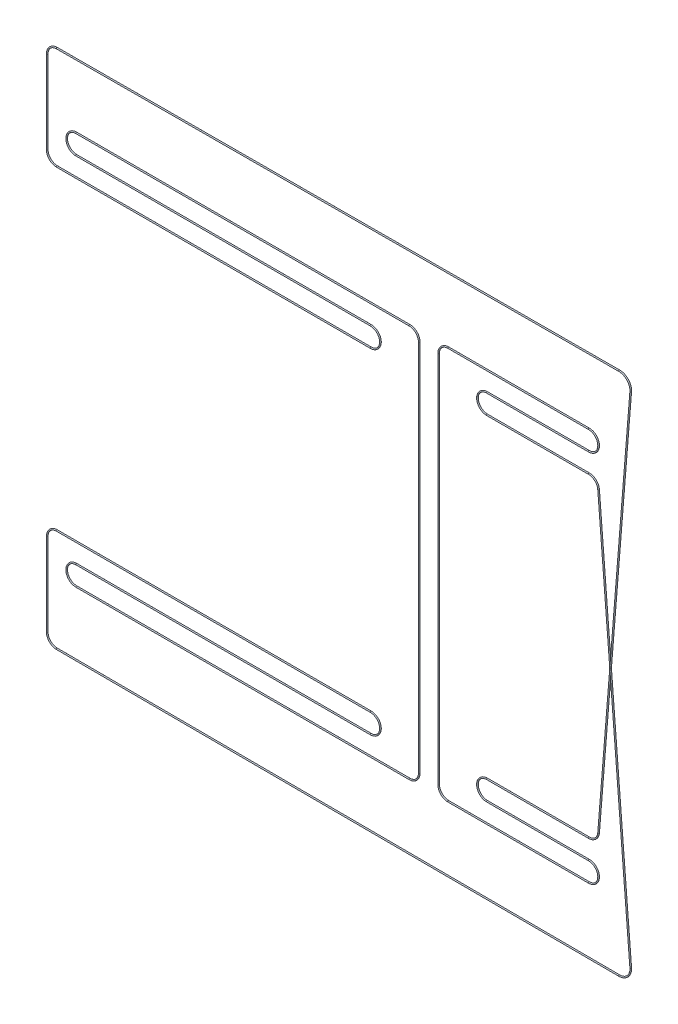
ISO-10303-21;
HEADER;
FILE_DESCRIPTION(('STEP AP214'),'2;1');
FILE_NAME('part.step','',(''),(''),'','','');
FILE_SCHEMA(('AUTOMOTIVE_DESIGN { 1 0 10303 214 1 1 1 1 }'));
ENDSEC;
DATA;
#1=APPLICATION_CONTEXT('core data for automotive mechanical design processes');
#2=APPLICATION_PROTOCOL_DEFINITION('international standard','automotive_design',2000,#1);
#3=PRODUCT_CONTEXT('',#1,'mechanical');
#4=PRODUCT('Part','Part','',(#3));
#5=PRODUCT_RELATED_PRODUCT_CATEGORY('part','',(#4));
#6=PRODUCT_DEFINITION_FORMATION('','',#4);
#7=PRODUCT_DEFINITION_CONTEXT('part definition',#1,'design');
#8=PRODUCT_DEFINITION('design','',#6,#7);
#9=PRODUCT_DEFINITION_SHAPE('','',#8);
#10=(LENGTH_UNIT() NAMED_UNIT(*) SI_UNIT(.MILLI.,.METRE.));
#11=(NAMED_UNIT(*) PLANE_ANGLE_UNIT() SI_UNIT($,.RADIAN.));
#12=(NAMED_UNIT(*) SI_UNIT($,.STERADIAN.) SOLID_ANGLE_UNIT());
#13=UNCERTAINTY_MEASURE_WITH_UNIT(LENGTH_MEASURE(1.E-05),#10,'distance_accuracy_value','');
#14=(GEOMETRIC_REPRESENTATION_CONTEXT(3) GLOBAL_UNCERTAINTY_ASSIGNED_CONTEXT((#13)) GLOBAL_UNIT_ASSIGNED_CONTEXT((#10,
#11,#12)) REPRESENTATION_CONTEXT('',''));
#15=CARTESIAN_POINT('',(0.,0.,0.));
#16=DIRECTION('',(0.,0.,1.));
#17=DIRECTION('',(1.,0.,0.));
#18=AXIS2_PLACEMENT_3D('',#15,#16,#17);
#19=CARTESIAN_POINT('',(462.434227680862,-51.7359796285489,-2.5));
#20=DIRECTION('',(-0.0804231969948115,0.996760808511818,0.));
#21=DIRECTION('',(0.,0.,1.));
#22=AXIS2_PLACEMENT_3D('',#19,#20,#21);
#23=CYLINDRICAL_SURFACE('',#22,0.5);
#24=CARTESIAN_POINT('',(445.83451280715,153.999999999999,-2.5));
#25=DIRECTION('',(0.,1.,0.));
#26=DIRECTION('',(-1.,0.,0.));
#27=AXIS2_PLACEMENT_3D('',#24,#25,#26);
#28=ELLIPSE('',#27,0.501624858973446,0.5);
#29=CARTESIAN_POINT('',(445.83451280715,153.999999999999,-2.));
#30=VERTEX_POINT('',#29);
#31=CARTESIAN_POINT('',(445.83451280715,153.999999999999,-3.));
#32=VERTEX_POINT('',#31);
#33=EDGE_CURVE('E25',#30,#32,#28,.T.);
#34=ORIENTED_EDGE('',*,*,#33,.F.);
#35=CARTESIAN_POINT('',(445.83451280715,153.999999999999,-2.5));
#36=DIRECTION('',(-1.,0.,0.));
#37=DIRECTION('',(0.,-1.,0.));
#38=AXIS2_PLACEMENT_3D('',#35,#36,#37);
#39=ELLIPSE('',#38,6.21711171258534,0.5);
#40=EDGE_CURVE('E31',#32,#30,#39,.T.);
#41=ORIENTED_EDGE('',*,*,#40,.F.);
#42=EDGE_LOOP('',(#34,#41));
#43=FACE_BOUND('',#42,.T.);
#44=CARTESIAN_POINT('',(462.434227680862,-51.7359796285489,-2.5));
#45=DIRECTION('',(0.0804231969948115,-0.996760808511818,0.));
#46=DIRECTION('',(0.,0.,-1.));
#47=AXIS2_PLACEMENT_3D('',#44,#45,#46);
#48=CIRCLE('',#47,0.5);
#49=CARTESIAN_POINT('',(462.932608085118,-51.6957680300515,-2.5));
#50=VERTEX_POINT('',#49);
#51=EDGE_CURVE('E275',#50,#50,#48,.T.);
#52=ORIENTED_EDGE('',*,*,#51,.F.);
#53=EDGE_LOOP('',(#52));
#54=FACE_BOUND('',#53,.T.);
#55=ADVANCED_FACE('F15',(#43,#54),#23,.T.);
#56=CARTESIAN_POINT('',(462.434227680862,-51.7359796285489,-2.5));
#57=DIRECTION('',(-0.0804231969948115,0.996760808511818,0.));
#58=DIRECTION('',(0.,0.,1.));
#59=AXIS2_PLACEMENT_3D('',#56,#57,#58);
#60=CYLINDRICAL_SURFACE('',#59,0.5);
#61=CARTESIAN_POINT('',(435.939086468095,276.643385575958,-2.5));
#62=DIRECTION('',(-0.0804231969948297,0.996760808511817,0.));
#63=DIRECTION('',(0.,0.,1.));
#64=AXIS2_PLACEMENT_3D('',#61,#62,#63);
#65=CIRCLE('',#64,0.5);
#66=CARTESIAN_POINT('',(436.43746687235,276.683597174456,-2.5));
#67=VERTEX_POINT('',#66);
#68=EDGE_CURVE('E48',#67,#67,#65,.T.);
#69=ORIENTED_EDGE('',*,*,#68,.F.);
#70=EDGE_LOOP('',(#69));
#71=FACE_BOUND('',#70,.T.);
#72=CARTESIAN_POINT('',(445.83451280715,153.999999999999,-2.5));
#73=DIRECTION('',(0.,-1.,0.));
#74=DIRECTION('',(-1.,0.,0.));
#75=AXIS2_PLACEMENT_3D('',#72,#73,#74);
#76=ELLIPSE('',#75,0.501624858973446,0.5);
#77=EDGE_CURVE('E37',#30,#32,#76,.T.);
#78=ORIENTED_EDGE('',*,*,#77,.F.);
#79=CARTESIAN_POINT('',(445.83451280715,153.999999999999,-2.5));
#80=DIRECTION('',(1.,0.,0.));
#81=DIRECTION('',(0.,-1.,0.));
#82=AXIS2_PLACEMENT_3D('',#79,#80,#81);
#83=ELLIPSE('',#82,6.21711171258534,0.5);
#84=EDGE_CURVE('E9',#32,#30,#83,.T.);
#85=ORIENTED_EDGE('',*,*,#84,.F.);
#86=EDGE_LOOP('',(#78,#85));
#87=FACE_BOUND('',#86,.T.);
#88=ADVANCED_FACE('F50',(#71,#87),#60,.T.);
#89=CARTESIAN_POINT('',(462.434227680863,359.73597962855,-2.5));
#90=DIRECTION('',(-0.0804231969948115,-0.996760808511818,0.));
#91=DIRECTION('',(-0.996760808511818,0.0804231969948115,0.));
#92=AXIS2_PLACEMENT_3D('',#89,#90,#91);
#93=CYLINDRICAL_SURFACE('',#92,0.5);
#94=CARTESIAN_POINT('',(462.434227680863,359.73597962855,-2.5));
#95=DIRECTION('',(0.0804231969947969,0.996760808511819,0.));
#96=DIRECTION('',(0.,0.,-1.));
#97=AXIS2_PLACEMENT_3D('',#94,#95,#96);
#98=CIRCLE('',#97,0.5);
#99=CARTESIAN_POINT('',(462.932608085118,359.695768030052,-2.5));
#100=VERTEX_POINT('',#99);
#101=EDGE_CURVE('E227',#100,#100,#98,.T.);
#102=ORIENTED_EDGE('',*,*,#101,.F.);
#103=EDGE_LOOP('',(#102));
#104=FACE_BOUND('',#103,.T.);
#105=ORIENTED_EDGE('',*,*,#84,.T.);
#106=ORIENTED_EDGE('',*,*,#33,.T.);
#107=EDGE_LOOP('',(#105,#106));
#108=FACE_BOUND('',#107,.T.);
#109=ADVANCED_FACE('F47',(#104,#108),#93,.T.);
#110=CARTESIAN_POINT('',(427.965,276.,-2.5));
#111=DIRECTION('',(0.,0.,-1.));
#112=DIRECTION('',(0.,-1.,0.));
#113=AXIS2_PLACEMENT_3D('',#110,#111,#112);
#114=TOROIDAL_SURFACE('',#113,8.00000000000008,0.5);
#115=CARTESIAN_POINT('',(427.965,284.,-2.5));
#116=DIRECTION('',(-1.,0.,0.));
#117=DIRECTION('',(0.,1.,0.));
#118=AXIS2_PLACEMENT_3D('',#115,#116,#117);
#119=CIRCLE('',#118,0.5);
#120=CARTESIAN_POINT('',(427.965,284.5,-2.5));
#121=VERTEX_POINT('',#120);
#122=EDGE_CURVE('E268',#121,#121,#119,.T.);
#123=CARTESIAN_POINT('',(427.965,276.,-2.5));
#124=DIRECTION('',(0.,0.,-1.));
#125=DIRECTION('',(0.,-1.,0.));
#126=AXIS2_PLACEMENT_3D('',#123,#124,#125);
#127=CIRCLE('',#126,8.50000000000008);
#128=EDGE_CURVE('',#121,#67,#127,.T.);
#129=ORIENTED_EDGE('',*,*,#122,.F.);
#130=ORIENTED_EDGE('',*,*,#68,.T.);
#131=ORIENTED_EDGE('',*,*,#128,.T.);
#132=ORIENTED_EDGE('',*,*,#128,.F.);
#133=EDGE_LOOP('',(#129,#131,#130,#132));
#134=FACE_BOUND('',#133,.T.);
#135=ADVANCED_FACE('F59',(#134),#114,.T.);
#136=CARTESIAN_POINT('',(344.038707856481,284.000000000001,-2.5));
#137=DIRECTION('',(1.,0.,0.));
#138=DIRECTION('',(0.,0.,1.));
#139=AXIS2_PLACEMENT_3D('',#136,#137,#138);
#140=CYLINDRICAL_SURFACE('',#139,0.5);
#141=ORIENTED_EDGE('',*,*,#122,.T.);
#142=EDGE_LOOP('',(#141));
#143=FACE_BOUND('',#142,.T.);
#144=CARTESIAN_POINT('',(344.038707856481,284.000000000001,-2.5));
#145=DIRECTION('',(-1.,0.,0.));
#146=DIRECTION('',(0.,1.,0.));
#147=AXIS2_PLACEMENT_3D('',#144,#145,#146);
#148=CIRCLE('',#147,0.5);
#149=CARTESIAN_POINT('',(344.038707856481,283.500000000001,-2.5));
#150=VERTEX_POINT('',#149);
#151=EDGE_CURVE('E265',#150,#150,#148,.T.);
#152=ORIENTED_EDGE('',*,*,#151,.F.);
#153=EDGE_LOOP('',(#152));
#154=FACE_BOUND('',#153,.T.);
#155=ADVANCED_FACE('F68',(#143,#154),#140,.T.);
#156=CARTESIAN_POINT('',(344.038707856481,292.,-2.5));
#157=DIRECTION('',(0.,0.,1.));
#158=DIRECTION('',(1.,0.,0.));
#159=AXIS2_PLACEMENT_3D('',#156,#157,#158);
#160=TOROIDAL_SURFACE('',#159,7.99999999999972,0.5);
#161=CARTESIAN_POINT('',(344.038707856481,300.,-2.5));
#162=DIRECTION('',(1.,0.,0.));
#163=DIRECTION('',(0.,1.,0.));
#164=AXIS2_PLACEMENT_3D('',#161,#162,#163);
#165=CIRCLE('',#164,0.5);
#166=CARTESIAN_POINT('',(344.038707856481,300.5,-2.5));
#167=VERTEX_POINT('',#166);
#168=EDGE_CURVE('E262',#167,#167,#165,.T.);
#169=CARTESIAN_POINT('',(344.038707856481,292.,-2.5));
#170=DIRECTION('',(0.,0.,1.));
#171=DIRECTION('',(1.,0.,0.));
#172=AXIS2_PLACEMENT_3D('',#169,#170,#171);
#173=CIRCLE('',#172,8.49999999999972);
#174=EDGE_CURVE('',#167,#150,#173,.T.);
#175=ORIENTED_EDGE('',*,*,#168,.F.);
#176=ORIENTED_EDGE('',*,*,#151,.T.);
#177=ORIENTED_EDGE('',*,*,#174,.T.);
#178=ORIENTED_EDGE('',*,*,#174,.F.);
#179=EDGE_LOOP('',(#175,#177,#176,#178));
#180=FACE_BOUND('',#179,.T.);
#181=ADVANCED_FACE('F71',(#180),#160,.T.);
#182=CARTESIAN_POINT('',(427.965,300.,-2.5));
#183=DIRECTION('',(-1.,0.,0.));
#184=DIRECTION('',(0.,0.,1.));
#185=AXIS2_PLACEMENT_3D('',#182,#183,#184);
#186=CYLINDRICAL_SURFACE('',#185,0.5);
#187=ORIENTED_EDGE('',*,*,#168,.T.);
#188=EDGE_LOOP('',(#187));
#189=FACE_BOUND('',#188,.T.);
#190=CARTESIAN_POINT('',(427.965,300.,-2.5));
#191=DIRECTION('',(1.,0.,0.));
#192=DIRECTION('',(0.,1.,0.));
#193=AXIS2_PLACEMENT_3D('',#190,#191,#192);
#194=CIRCLE('',#193,0.5);
#195=CARTESIAN_POINT('',(427.965,299.5,-2.5));
#196=VERTEX_POINT('',#195);
#197=EDGE_CURVE('E259',#196,#196,#194,.T.);
#198=ORIENTED_EDGE('',*,*,#197,.F.);
#199=EDGE_LOOP('',(#198));
#200=FACE_BOUND('',#199,.T.);
#201=ADVANCED_FACE('F73',(#189,#200),#186,.T.);
#202=CARTESIAN_POINT('',(427.965,308.,-2.5));
#203=DIRECTION('',(0.,0.,-1.));
#204=DIRECTION('',(0.,-1.,0.));
#205=AXIS2_PLACEMENT_3D('',#202,#203,#204);
#206=TOROIDAL_SURFACE('',#205,8.00000000000047,0.5);
#207=CARTESIAN_POINT('',(427.965,316.000000000001,-2.5));
#208=DIRECTION('',(-1.,0.,0.));
#209=DIRECTION('',(0.,1.,0.));
#210=AXIS2_PLACEMENT_3D('',#207,#208,#209);
#211=CIRCLE('',#210,0.5);
#212=CARTESIAN_POINT('',(427.965,316.500000000001,-2.5));
#213=VERTEX_POINT('',#212);
#214=EDGE_CURVE('E256',#213,#213,#211,.T.);
#215=CARTESIAN_POINT('',(427.965,308.,-2.5));
#216=DIRECTION('',(0.,0.,-1.));
#217=DIRECTION('',(0.,-1.,0.));
#218=AXIS2_PLACEMENT_3D('',#215,#216,#217);
#219=CIRCLE('',#218,8.50000000000047);
#220=EDGE_CURVE('',#213,#196,#219,.T.);
#221=ORIENTED_EDGE('',*,*,#214,.F.);
#222=ORIENTED_EDGE('',*,*,#197,.T.);
#223=ORIENTED_EDGE('',*,*,#220,.T.);
#224=ORIENTED_EDGE('',*,*,#220,.F.);
#225=EDGE_LOOP('',(#221,#223,#222,#224));
#226=FACE_BOUND('',#225,.T.);
#227=ADVANCED_FACE('F76',(#226),#206,.T.);
#228=CARTESIAN_POINT('',(312.038707856481,316.000000000001,-2.5));
#229=DIRECTION('',(1.,0.,0.));
#230=DIRECTION('',(0.,1.,0.));
#231=AXIS2_PLACEMENT_3D('',#228,#229,#230);
#232=CYLINDRICAL_SURFACE('',#231,0.5);
#233=ORIENTED_EDGE('',*,*,#214,.T.);
#234=EDGE_LOOP('',(#233));
#235=FACE_BOUND('',#234,.T.);
#236=CARTESIAN_POINT('',(312.038707856481,316.000000000001,-2.5));
#237=DIRECTION('',(-1.,0.,0.));
#238=DIRECTION('',(0.,1.,0.));
#239=AXIS2_PLACEMENT_3D('',#236,#237,#238);
#240=CIRCLE('',#239,0.5);
#241=CARTESIAN_POINT('',(312.038707856481,316.500000000001,-2.5));
#242=VERTEX_POINT('',#241);
#243=EDGE_CURVE('E253',#242,#242,#240,.T.);
#244=ORIENTED_EDGE('',*,*,#243,.F.);
#245=EDGE_LOOP('',(#244));
#246=FACE_BOUND('',#245,.T.);
#247=ADVANCED_FACE('F78',(#235,#246),#232,.T.);
#248=CARTESIAN_POINT('',(312.038707856481,308.000000000001,-2.5));
#249=DIRECTION('',(0.,0.,-1.));
#250=DIRECTION('',(0.,-1.,0.));
#251=AXIS2_PLACEMENT_3D('',#248,#249,#250);
#252=TOROIDAL_SURFACE('',#251,8.00000000000018,0.5);
#253=CARTESIAN_POINT('',(304.038707856481,308.000000000001,-2.5));
#254=DIRECTION('',(0.,-1.,0.));
#255=DIRECTION('',(0.,0.,-1.));
#256=AXIS2_PLACEMENT_3D('',#253,#254,#255);
#257=CIRCLE('',#256,0.5);
#258=CARTESIAN_POINT('',(303.538707856481,308.000000000001,-2.5));
#259=VERTEX_POINT('',#258);
#260=EDGE_CURVE('E250',#259,#259,#257,.T.);
#261=CARTESIAN_POINT('',(312.038707856481,308.000000000001,-2.5));
#262=DIRECTION('',(0.,0.,-1.));
#263=DIRECTION('',(0.,-1.,0.));
#264=AXIS2_PLACEMENT_3D('',#261,#262,#263);
#265=CIRCLE('',#264,8.50000000000018);
#266=EDGE_CURVE('',#259,#242,#265,.T.);
#267=ORIENTED_EDGE('',*,*,#260,.F.);
#268=ORIENTED_EDGE('',*,*,#243,.T.);
#269=ORIENTED_EDGE('',*,*,#266,.T.);
#270=ORIENTED_EDGE('',*,*,#266,.F.);
#271=EDGE_LOOP('',(#267,#269,#268,#270));
#272=FACE_BOUND('',#271,.T.);
#273=ADVANCED_FACE('F81',(#272),#252,.T.);
#274=CARTESIAN_POINT('',(304.038707856481,3.19744231092045E-13,-2.5));
#275=DIRECTION('',(0.,1.,0.));
#276=DIRECTION('',(1.,0.,0.));
#277=AXIS2_PLACEMENT_3D('',#274,#275,#276);
#278=CYLINDRICAL_SURFACE('',#277,0.5);
#279=ORIENTED_EDGE('',*,*,#260,.T.);
#280=EDGE_LOOP('',(#279));
#281=FACE_BOUND('',#280,.T.);
#282=CARTESIAN_POINT('',(304.038707856481,3.19744231092045E-13,-2.5));
#283=DIRECTION('',(0.,-1.,0.));
#284=DIRECTION('',(0.,0.,-1.));
#285=AXIS2_PLACEMENT_3D('',#282,#283,#284);
#286=CIRCLE('',#285,0.5);
#287=CARTESIAN_POINT('',(303.538707856481,3.23074900165921E-13,-2.5));
#288=VERTEX_POINT('',#287);
#289=EDGE_CURVE('E247',#288,#288,#286,.T.);
#290=ORIENTED_EDGE('',*,*,#289,.F.);
#291=EDGE_LOOP('',(#290));
#292=FACE_BOUND('',#291,.T.);
#293=ADVANCED_FACE('F83',(#281,#292),#278,.T.);
#294=CARTESIAN_POINT('',(312.038707856481,2.66453525910038E-13,-2.5));
#295=DIRECTION('',(0.,0.,-1.));
#296=DIRECTION('',(0.,-1.,0.));
#297=AXIS2_PLACEMENT_3D('',#294,#295,#296);
#298=TOROIDAL_SURFACE('',#297,8.00000000000019,0.5);
#299=CARTESIAN_POINT('',(312.038707856481,-7.99999999999993,-2.5));
#300=DIRECTION('',(1.,0.,0.));
#301=DIRECTION('',(0.,1.,0.));
#302=AXIS2_PLACEMENT_3D('',#299,#300,#301);
#303=CIRCLE('',#302,0.5);
#304=CARTESIAN_POINT('',(312.038707856481,-8.49999999999993,-2.5));
#305=VERTEX_POINT('',#304);
#306=EDGE_CURVE('E244',#305,#305,#303,.T.);
#307=CARTESIAN_POINT('',(312.038707856481,2.66453525910038E-13,-2.5));
#308=DIRECTION('',(0.,0.,-1.));
#309=DIRECTION('',(0.,-1.,0.));
#310=AXIS2_PLACEMENT_3D('',#307,#308,#309);
#311=CIRCLE('',#310,8.5000000000002);
#312=EDGE_CURVE('',#305,#288,#311,.T.);
#313=ORIENTED_EDGE('',*,*,#306,.F.);
#314=ORIENTED_EDGE('',*,*,#289,.T.);
#315=ORIENTED_EDGE('',*,*,#312,.T.);
#316=ORIENTED_EDGE('',*,*,#312,.F.);
#317=EDGE_LOOP('',(#313,#315,#314,#316));
#318=FACE_BOUND('',#317,.T.);
#319=ADVANCED_FACE('F86',(#318),#298,.T.);
#320=CARTESIAN_POINT('',(427.965,-7.99999999999943,-2.5));
#321=DIRECTION('',(-1.,0.,0.));
#322=DIRECTION('',(0.,1.,0.));
#323=AXIS2_PLACEMENT_3D('',#320,#321,#322);
#324=CYLINDRICAL_SURFACE('',#323,0.5);
#325=ORIENTED_EDGE('',*,*,#306,.T.);
#326=EDGE_LOOP('',(#325));
#327=FACE_BOUND('',#326,.T.);
#328=CARTESIAN_POINT('',(427.965,-7.99999999999943,-2.5));
#329=DIRECTION('',(1.,0.,0.));
#330=DIRECTION('',(0.,1.,0.));
#331=AXIS2_PLACEMENT_3D('',#328,#329,#330);
#332=CIRCLE('',#331,0.5);
#333=CARTESIAN_POINT('',(427.965,-8.49999999999944,-2.5));
#334=VERTEX_POINT('',#333);
#335=EDGE_CURVE('E241',#334,#334,#332,.T.);
#336=ORIENTED_EDGE('',*,*,#335,.F.);
#337=EDGE_LOOP('',(#336));
#338=FACE_BOUND('',#337,.T.);
#339=ADVANCED_FACE('F107',(#327,#338),#324,.T.);
#340=CARTESIAN_POINT('',(427.965,7.62723217917483E-13,-2.5));
#341=DIRECTION('',(0.,0.,-1.));
#342=DIRECTION('',(0.,-1.,0.));
#343=AXIS2_PLACEMENT_3D('',#340,#341,#342);
#344=TOROIDAL_SURFACE('',#343,8.0000000000002,0.5);
#345=CARTESIAN_POINT('',(427.965,8.00000000000096,-2.5));
#346=DIRECTION('',(-1.,0.,0.));
#347=DIRECTION('',(0.,1.,0.));
#348=AXIS2_PLACEMENT_3D('',#345,#346,#347);
#349=CIRCLE('',#348,0.5);
#350=CARTESIAN_POINT('',(427.965,8.50000000000096,-2.5));
#351=VERTEX_POINT('',#350);
#352=EDGE_CURVE('E238',#351,#351,#349,.T.);
#353=CARTESIAN_POINT('',(427.965,7.62723217917483E-13,-2.5));
#354=DIRECTION('',(0.,0.,-1.));
#355=DIRECTION('',(0.,-1.,0.));
#356=AXIS2_PLACEMENT_3D('',#353,#354,#355);
#357=CIRCLE('',#356,8.5000000000002);
#358=EDGE_CURVE('',#351,#334,#357,.T.);
#359=ORIENTED_EDGE('',*,*,#352,.F.);
#360=ORIENTED_EDGE('',*,*,#335,.T.);
#361=ORIENTED_EDGE('',*,*,#358,.T.);
#362=ORIENTED_EDGE('',*,*,#358,.F.);
#363=EDGE_LOOP('',(#359,#361,#360,#362));
#364=FACE_BOUND('',#363,.T.);
#365=ADVANCED_FACE('F92',(#364),#344,.T.);
#366=CARTESIAN_POINT('',(344.038707856481,8.0000000000006,-2.5));
#367=DIRECTION('',(1.,0.,0.));
#368=DIRECTION('',(0.,1.,0.));
#369=AXIS2_PLACEMENT_3D('',#366,#367,#368);
#370=CYLINDRICAL_SURFACE('',#369,0.5);
#371=ORIENTED_EDGE('',*,*,#352,.T.);
#372=EDGE_LOOP('',(#371));
#373=FACE_BOUND('',#372,.T.);
#374=CARTESIAN_POINT('',(344.038707856481,8.0000000000006,-2.5));
#375=DIRECTION('',(-1.,0.,0.));
#376=DIRECTION('',(0.,1.,0.));
#377=AXIS2_PLACEMENT_3D('',#374,#375,#376);
#378=CIRCLE('',#377,0.5);
#379=CARTESIAN_POINT('',(344.038707856481,7.50000000000059,-2.5));
#380=VERTEX_POINT('',#379);
#381=EDGE_CURVE('E235',#380,#380,#378,.T.);
#382=ORIENTED_EDGE('',*,*,#381,.F.);
#383=EDGE_LOOP('',(#382));
#384=FACE_BOUND('',#383,.T.);
#385=ADVANCED_FACE('F88',(#373,#384),#370,.T.);
#386=CARTESIAN_POINT('',(344.038707856481,16.0000000000004,-2.5));
#387=DIRECTION('',(0.,0.,1.));
#388=DIRECTION('',(1.,0.,0.));
#389=AXIS2_PLACEMENT_3D('',#386,#387,#388);
#390=TOROIDAL_SURFACE('',#389,7.99999999999981,0.5);
#391=CARTESIAN_POINT('',(344.038707856481,24.0000000000002,-2.5));
#392=DIRECTION('',(1.,0.,0.));
#393=DIRECTION('',(0.,1.,0.));
#394=AXIS2_PLACEMENT_3D('',#391,#392,#393);
#395=CIRCLE('',#394,0.5);
#396=CARTESIAN_POINT('',(344.038707856481,24.5000000000002,-2.5));
#397=VERTEX_POINT('',#396);
#398=EDGE_CURVE('E232',#397,#397,#395,.T.);
#399=CARTESIAN_POINT('',(344.038707856481,16.0000000000004,-2.5));
#400=DIRECTION('',(0.,0.,1.));
#401=DIRECTION('',(1.,0.,0.));
#402=AXIS2_PLACEMENT_3D('',#399,#400,#401);
#403=CIRCLE('',#402,8.49999999999982);
#404=EDGE_CURVE('',#397,#380,#403,.T.);
#405=ORIENTED_EDGE('',*,*,#398,.F.);
#406=ORIENTED_EDGE('',*,*,#381,.T.);
#407=ORIENTED_EDGE('',*,*,#404,.T.);
#408=ORIENTED_EDGE('',*,*,#404,.F.);
#409=EDGE_LOOP('',(#405,#407,#406,#408));
#410=FACE_BOUND('',#409,.T.);
#411=ADVANCED_FACE('F91',(#410),#390,.T.);
#412=CARTESIAN_POINT('',(427.965,24.0000000000006,-2.5));
#413=DIRECTION('',(-1.,0.,0.));
#414=DIRECTION('',(0.,1.,0.));
#415=AXIS2_PLACEMENT_3D('',#412,#413,#414);
#416=CYLINDRICAL_SURFACE('',#415,0.5);
#417=ORIENTED_EDGE('',*,*,#398,.T.);
#418=EDGE_LOOP('',(#417));
#419=FACE_BOUND('',#418,.T.);
#420=CARTESIAN_POINT('',(427.965,24.0000000000006,-2.5));
#421=DIRECTION('',(1.,0.,0.));
#422=DIRECTION('',(0.,1.,0.));
#423=AXIS2_PLACEMENT_3D('',#420,#421,#422);
#424=CIRCLE('',#423,0.5);
#425=CARTESIAN_POINT('',(427.965,23.5000000000006,-2.5));
#426=VERTEX_POINT('',#425);
#427=EDGE_CURVE('E44',#426,#426,#424,.T.);
#428=ORIENTED_EDGE('',*,*,#427,.F.);
#429=EDGE_LOOP('',(#428));
#430=FACE_BOUND('',#429,.T.);
#431=ADVANCED_FACE('F94',(#419,#430),#416,.T.);
#432=CARTESIAN_POINT('',(427.965,32.0000000000008,-2.5));
#433=DIRECTION('',(0.,0.,-1.));
#434=DIRECTION('',(0.,-1.,0.));
#435=AXIS2_PLACEMENT_3D('',#432,#433,#434);
#436=TOROIDAL_SURFACE('',#435,8.00000000000019,0.5);
#437=CARTESIAN_POINT('',(435.939086468095,31.3566144240421,-2.5));
#438=DIRECTION('',(0.0804231969947969,0.996760808511819,0.));
#439=DIRECTION('',(0.,0.,-1.));
#440=AXIS2_PLACEMENT_3D('',#437,#438,#439);
#441=CIRCLE('',#440,0.5);
#442=CARTESIAN_POINT('',(436.437466872351,31.3164028255447,-2.5));
#443=VERTEX_POINT('',#442);
#444=EDGE_CURVE('E38',#443,#443,#441,.T.);
#445=CARTESIAN_POINT('',(427.965,32.0000000000008,-2.5));
#446=DIRECTION('',(0.,0.,-1.));
#447=DIRECTION('',(0.,-1.,0.));
#448=AXIS2_PLACEMENT_3D('',#445,#446,#447);
#449=CIRCLE('',#448,8.50000000000019);
#450=EDGE_CURVE('',#443,#426,#449,.T.);
#451=ORIENTED_EDGE('',*,*,#444,.F.);
#452=ORIENTED_EDGE('',*,*,#427,.T.);
#453=ORIENTED_EDGE('',*,*,#450,.T.);
#454=ORIENTED_EDGE('',*,*,#450,.F.);
#455=EDGE_LOOP('',(#451,#453,#452,#454));
#456=FACE_BOUND('',#455,.T.);
#457=ADVANCED_FACE('F97',(#456),#436,.T.);
#458=CARTESIAN_POINT('',(462.434227680863,359.73597962855,-2.5));
#459=DIRECTION('',(-0.0804231969948115,-0.996760808511818,0.));
#460=DIRECTION('',(-0.996760808511818,0.0804231969948115,0.));
#461=AXIS2_PLACEMENT_3D('',#458,#459,#460);
#462=CYLINDRICAL_SURFACE('',#461,0.5);
#463=ORIENTED_EDGE('',*,*,#77,.T.);
#464=ORIENTED_EDGE('',*,*,#40,.T.);
#465=EDGE_LOOP('',(#463,#464));
#466=FACE_BOUND('',#465,.T.);
#467=ORIENTED_EDGE('',*,*,#444,.T.);
#468=EDGE_LOOP('',(#467));
#469=FACE_BOUND('',#468,.T.);
#470=ADVANCED_FACE('F40',(#466,#469),#462,.T.);
#471=CARTESIAN_POINT('',(452.965,360.5,-2.5));
#472=DIRECTION('',(0.,0.,-1.));
#473=DIRECTION('',(0.,-1.,0.));
#474=AXIS2_PLACEMENT_3D('',#471,#472,#473);
#475=TOROIDAL_SURFACE('',#474,9.50000000000005,0.5);
#476=CARTESIAN_POINT('',(452.934269917945,369.999950297873,-2.5));
#477=DIRECTION('',(-0.999994768197156,-0.00323474547945702,0.));
#478=DIRECTION('',(-0.00323474547945702,0.999994768197156,0.));
#479=AXIS2_PLACEMENT_3D('',#476,#477,#478);
#480=CIRCLE('',#479,0.5);
#481=CARTESIAN_POINT('',(452.932652545206,370.499947681972,-2.5));
#482=VERTEX_POINT('',#481);
#483=EDGE_CURVE('E224',#482,#482,#480,.T.);
#484=CARTESIAN_POINT('',(452.965,360.5,-2.5));
#485=DIRECTION('',(0.,0.,-1.));
#486=DIRECTION('',(0.,-1.,0.));
#487=AXIS2_PLACEMENT_3D('',#484,#485,#486);
#488=CIRCLE('',#487,10.);
#489=EDGE_CURVE('',#482,#100,#488,.T.);
#490=ORIENTED_EDGE('',*,*,#483,.F.);
#491=ORIENTED_EDGE('',*,*,#101,.T.);
#492=ORIENTED_EDGE('',*,*,#489,.T.);
#493=ORIENTED_EDGE('',*,*,#489,.F.);
#494=EDGE_LOOP('',(#490,#492,#491,#493));
#495=FACE_BOUND('',#494,.T.);
#496=ADVANCED_FACE('F101',(#495),#475,.T.);
#497=CARTESIAN_POINT('',(-10.7758779638355,368.499958145578,-2.5));
#498=DIRECTION('',(0.999994768197156,0.00323474547944313,0.));
#499=DIRECTION('',(0.,0.,-1.));
#500=AXIS2_PLACEMENT_3D('',#497,#498,#499);
#501=CYLINDRICAL_SURFACE('',#500,0.5);
#502=ORIENTED_EDGE('',*,*,#483,.T.);
#503=EDGE_LOOP('',(#502));
#504=FACE_BOUND('',#503,.T.);
#505=CARTESIAN_POINT('',(-10.7758779638355,368.499958145578,-2.5));
#506=DIRECTION('',(-0.999994768197156,-0.00323474547945702,0.));
#507=DIRECTION('',(-0.00323474547945702,0.999994768197156,0.));
#508=AXIS2_PLACEMENT_3D('',#505,#506,#507);
#509=CIRCLE('',#508,0.5);
#510=CARTESIAN_POINT('',(-10.7774953365753,368.999955529676,-2.5));
#511=VERTEX_POINT('',#510);
#512=EDGE_CURVE('E221',#511,#511,#509,.T.);
#513=ORIENTED_EDGE('',*,*,#512,.F.);
#514=EDGE_LOOP('',(#513));
#515=FACE_BOUND('',#514,.T.);
#516=ADVANCED_FACE('F102',(#504,#515),#501,.T.);
#517=CARTESIAN_POINT('',(-10.7500000000001,360.500000000001,-2.5));
#518=DIRECTION('',(0.,0.,-1.));
#519=DIRECTION('',(0.,-1.,0.));
#520=AXIS2_PLACEMENT_3D('',#517,#518,#519);
#521=TOROIDAL_SURFACE('',#520,7.99999999999994,0.5);
#522=CARTESIAN_POINT('',(-18.7500000000001,360.500000000001,-2.5));
#523=DIRECTION('',(0.,-1.,0.));
#524=DIRECTION('',(0.,0.,-1.));
#525=AXIS2_PLACEMENT_3D('',#522,#523,#524);
#526=CIRCLE('',#525,0.5);
#527=CARTESIAN_POINT('',(-19.2500000000001,360.500000000001,-2.5));
#528=VERTEX_POINT('',#527);
#529=EDGE_CURVE('E218',#528,#528,#526,.T.);
#530=CARTESIAN_POINT('',(-10.7500000000001,360.500000000001,-2.5));
#531=DIRECTION('',(0.,0.,-1.));
#532=DIRECTION('',(0.,-1.,0.));
#533=AXIS2_PLACEMENT_3D('',#530,#531,#532);
#534=CIRCLE('',#533,8.49999999999994);
#535=EDGE_CURVE('',#528,#511,#534,.T.);
#536=ORIENTED_EDGE('',*,*,#529,.F.);
#537=ORIENTED_EDGE('',*,*,#512,.T.);
#538=ORIENTED_EDGE('',*,*,#535,.T.);
#539=ORIENTED_EDGE('',*,*,#535,.F.);
#540=EDGE_LOOP('',(#536,#538,#537,#539));
#541=FACE_BOUND('',#540,.T.);
#542=ADVANCED_FACE('F105',(#541),#521,.T.);
#543=CARTESIAN_POINT('',(-18.7500000000001,292.000000000001,-2.5));
#544=DIRECTION('',(0.,1.,0.));
#545=DIRECTION('',(1.,0.,0.));
#546=AXIS2_PLACEMENT_3D('',#543,#544,#545);
#547=CYLINDRICAL_SURFACE('',#546,0.5);
#548=ORIENTED_EDGE('',*,*,#529,.T.);
#549=EDGE_LOOP('',(#548));
#550=FACE_BOUND('',#549,.T.);
#551=CARTESIAN_POINT('',(-18.7500000000001,292.000000000001,-2.5));
#552=DIRECTION('',(0.,-1.,0.));
#553=DIRECTION('',(0.,0.,-1.));
#554=AXIS2_PLACEMENT_3D('',#551,#552,#553);
#555=CIRCLE('',#554,0.5);
#556=CARTESIAN_POINT('',(-19.2500000000001,292.000000000001,-2.5));
#557=VERTEX_POINT('',#556);
#558=EDGE_CURVE('E215',#557,#557,#555,.T.);
#559=ORIENTED_EDGE('',*,*,#558,.F.);
#560=EDGE_LOOP('',(#559));
#561=FACE_BOUND('',#560,.T.);
#562=ADVANCED_FACE('F111',(#550,#561),#547,.T.);
#563=CARTESIAN_POINT('',(-10.75,292.000000000001,-2.5));
#564=DIRECTION('',(0.,0.,-1.));
#565=DIRECTION('',(0.,-1.,0.));
#566=AXIS2_PLACEMENT_3D('',#563,#564,#565);
#567=TOROIDAL_SURFACE('',#566,8.00000000000004,0.5);
#568=CARTESIAN_POINT('',(-10.7500000000001,284.000000000001,-2.5));
#569=DIRECTION('',(1.,0.,0.));
#570=DIRECTION('',(0.,1.,0.));
#571=AXIS2_PLACEMENT_3D('',#568,#569,#570);
#572=CIRCLE('',#571,0.5);
#573=CARTESIAN_POINT('',(-10.7500000000001,283.500000000001,-2.5));
#574=VERTEX_POINT('',#573);
#575=EDGE_CURVE('E212',#574,#574,#572,.T.);
#576=CARTESIAN_POINT('',(-10.75,292.000000000001,-2.5));
#577=DIRECTION('',(0.,0.,-1.));
#578=DIRECTION('',(0.,-1.,0.));
#579=AXIS2_PLACEMENT_3D('',#576,#577,#578);
#580=CIRCLE('',#579,8.50000000000004);
#581=EDGE_CURVE('',#574,#557,#580,.T.);
#582=ORIENTED_EDGE('',*,*,#575,.F.);
#583=ORIENTED_EDGE('',*,*,#558,.T.);
#584=ORIENTED_EDGE('',*,*,#581,.T.);
#585=ORIENTED_EDGE('',*,*,#581,.F.);
#586=EDGE_LOOP('',(#582,#584,#583,#585));
#587=FACE_BOUND('',#586,.T.);
#588=ADVANCED_FACE('F114',(#587),#567,.T.);
#589=CARTESIAN_POINT('',(248.038707856481,284.,-2.5));
#590=DIRECTION('',(-1.,0.,0.));
#591=DIRECTION('',(0.,0.,1.));
#592=AXIS2_PLACEMENT_3D('',#589,#590,#591);
#593=CYLINDRICAL_SURFACE('',#592,0.5);
#594=ORIENTED_EDGE('',*,*,#575,.T.);
#595=EDGE_LOOP('',(#594));
#596=FACE_BOUND('',#595,.T.);
#597=CARTESIAN_POINT('',(248.038707856481,284.,-2.5));
#598=DIRECTION('',(1.,0.,0.));
#599=DIRECTION('',(0.,1.,0.));
#600=AXIS2_PLACEMENT_3D('',#597,#598,#599);
#601=CIRCLE('',#600,0.5);
#602=CARTESIAN_POINT('',(248.038707856481,283.5,-2.5));
#603=VERTEX_POINT('',#602);
#604=EDGE_CURVE('E209',#603,#603,#601,.T.);
#605=ORIENTED_EDGE('',*,*,#604,.F.);
#606=EDGE_LOOP('',(#605));
#607=FACE_BOUND('',#606,.T.);
#608=ADVANCED_FACE('F116',(#596,#607),#593,.T.);
#609=CARTESIAN_POINT('',(248.038707856481,292.,-2.5));
#610=DIRECTION('',(0.,0.,-1.));
#611=DIRECTION('',(0.,-1.,0.));
#612=AXIS2_PLACEMENT_3D('',#609,#610,#611);
#613=TOROIDAL_SURFACE('',#612,8.00000000000004,0.5);
#614=CARTESIAN_POINT('',(248.038707856481,300.,-2.5));
#615=DIRECTION('',(-1.,0.,0.));
#616=DIRECTION('',(0.,1.,0.));
#617=AXIS2_PLACEMENT_3D('',#614,#615,#616);
#618=CIRCLE('',#617,0.5);
#619=CARTESIAN_POINT('',(248.038707856481,300.5,-2.5));
#620=VERTEX_POINT('',#619);
#621=EDGE_CURVE('E206',#620,#620,#618,.T.);
#622=CARTESIAN_POINT('',(248.038707856481,292.,-2.5));
#623=DIRECTION('',(0.,0.,-1.));
#624=DIRECTION('',(0.,-1.,0.));
#625=AXIS2_PLACEMENT_3D('',#622,#623,#624);
#626=CIRCLE('',#625,8.50000000000004);
#627=EDGE_CURVE('',#620,#603,#626,.T.);
#628=ORIENTED_EDGE('',*,*,#621,.F.);
#629=ORIENTED_EDGE('',*,*,#604,.T.);
#630=ORIENTED_EDGE('',*,*,#627,.T.);
#631=ORIENTED_EDGE('',*,*,#627,.F.);
#632=EDGE_LOOP('',(#628,#630,#629,#631));
#633=FACE_BOUND('',#632,.T.);
#634=ADVANCED_FACE('F119',(#633),#613,.T.);
#635=CARTESIAN_POINT('',(5.24999999999994,300.000000000001,-2.5));
#636=DIRECTION('',(1.,0.,0.));
#637=DIRECTION('',(0.,0.,1.));
#638=AXIS2_PLACEMENT_3D('',#635,#636,#637);
#639=CYLINDRICAL_SURFACE('',#638,0.5);
#640=ORIENTED_EDGE('',*,*,#621,.T.);
#641=EDGE_LOOP('',(#640));
#642=FACE_BOUND('',#641,.T.);
#643=CARTESIAN_POINT('',(5.24999999999994,300.000000000001,-2.5));
#644=DIRECTION('',(-1.,0.,0.));
#645=DIRECTION('',(0.,1.,0.));
#646=AXIS2_PLACEMENT_3D('',#643,#644,#645);
#647=CIRCLE('',#646,0.5);
#648=CARTESIAN_POINT('',(5.24999999999994,299.500000000001,-2.5));
#649=VERTEX_POINT('',#648);
#650=EDGE_CURVE('E203',#649,#649,#647,.T.);
#651=ORIENTED_EDGE('',*,*,#650,.F.);
#652=EDGE_LOOP('',(#651));
#653=FACE_BOUND('',#652,.T.);
#654=ADVANCED_FACE('F121',(#642,#653),#639,.T.);
#655=CARTESIAN_POINT('',(5.24999999999999,308.000000000001,-2.5));
#656=DIRECTION('',(0.,0.,1.));
#657=DIRECTION('',(1.,0.,0.));
#658=AXIS2_PLACEMENT_3D('',#655,#656,#657);
#659=TOROIDAL_SURFACE('',#658,7.99999999999997,0.5);
#660=CARTESIAN_POINT('',(5.25000000000006,316.000000000001,-2.5));
#661=DIRECTION('',(1.,0.,0.));
#662=DIRECTION('',(0.,1.,0.));
#663=AXIS2_PLACEMENT_3D('',#660,#661,#662);
#664=CIRCLE('',#663,0.5);
#665=CARTESIAN_POINT('',(5.25000000000006,316.500000000001,-2.5));
#666=VERTEX_POINT('',#665);
#667=EDGE_CURVE('E200',#666,#666,#664,.T.);
#668=CARTESIAN_POINT('',(5.24999999999999,308.000000000001,-2.5));
#669=DIRECTION('',(0.,0.,1.));
#670=DIRECTION('',(1.,0.,0.));
#671=AXIS2_PLACEMENT_3D('',#668,#669,#670);
#672=CIRCLE('',#671,8.49999999999997);
#673=EDGE_CURVE('',#666,#649,#672,.T.);
#674=ORIENTED_EDGE('',*,*,#667,.F.);
#675=ORIENTED_EDGE('',*,*,#650,.T.);
#676=ORIENTED_EDGE('',*,*,#673,.T.);
#677=ORIENTED_EDGE('',*,*,#673,.F.);
#678=EDGE_LOOP('',(#674,#676,#675,#677));
#679=FACE_BOUND('',#678,.T.);
#680=ADVANCED_FACE('F124',(#679),#659,.T.);
#681=CARTESIAN_POINT('',(280.038707856481,316.,-2.5));
#682=DIRECTION('',(-1.,0.,0.));
#683=DIRECTION('',(0.,0.,1.));
#684=AXIS2_PLACEMENT_3D('',#681,#682,#683);
#685=CYLINDRICAL_SURFACE('',#684,0.5);
#686=ORIENTED_EDGE('',*,*,#667,.T.);
#687=EDGE_LOOP('',(#686));
#688=FACE_BOUND('',#687,.T.);
#689=CARTESIAN_POINT('',(280.038707856481,316.,-2.5));
#690=DIRECTION('',(1.,0.,0.));
#691=DIRECTION('',(0.,1.,0.));
#692=AXIS2_PLACEMENT_3D('',#689,#690,#691);
#693=CIRCLE('',#692,0.5);
#694=CARTESIAN_POINT('',(280.038707856481,316.5,-2.5));
#695=VERTEX_POINT('',#694);
#696=EDGE_CURVE('E197',#695,#695,#693,.T.);
#697=ORIENTED_EDGE('',*,*,#696,.F.);
#698=EDGE_LOOP('',(#697));
#699=FACE_BOUND('',#698,.T.);
#700=ADVANCED_FACE('F126',(#688,#699),#685,.T.);
#701=CARTESIAN_POINT('',(280.038707856481,308.,-2.5));
#702=DIRECTION('',(0.,0.,1.));
#703=DIRECTION('',(1.,0.,0.));
#704=AXIS2_PLACEMENT_3D('',#701,#702,#703);
#705=TOROIDAL_SURFACE('',#704,7.99999999999994,0.5);
#706=CARTESIAN_POINT('',(288.038707856481,308.,-2.5));
#707=DIRECTION('',(0.,-1.,0.));
#708=DIRECTION('',(0.,0.,-1.));
#709=AXIS2_PLACEMENT_3D('',#706,#707,#708);
#710=CIRCLE('',#709,0.5);
#711=CARTESIAN_POINT('',(288.538707856481,308.,-2.5));
#712=VERTEX_POINT('',#711);
#713=EDGE_CURVE('E194',#712,#712,#710,.T.);
#714=CARTESIAN_POINT('',(280.038707856481,308.,-2.5));
#715=DIRECTION('',(0.,0.,1.));
#716=DIRECTION('',(1.,0.,0.));
#717=AXIS2_PLACEMENT_3D('',#714,#715,#716);
#718=CIRCLE('',#717,8.49999999999994);
#719=EDGE_CURVE('',#712,#695,#718,.T.);
#720=ORIENTED_EDGE('',*,*,#713,.F.);
#721=ORIENTED_EDGE('',*,*,#696,.T.);
#722=ORIENTED_EDGE('',*,*,#719,.T.);
#723=ORIENTED_EDGE('',*,*,#719,.F.);
#724=EDGE_LOOP('',(#720,#722,#721,#723));
#725=FACE_BOUND('',#724,.T.);
#726=ADVANCED_FACE('F129',(#725),#705,.T.);
#727=CARTESIAN_POINT('',(288.038707856481,2.1316282072803E-13,-2.5));
#728=DIRECTION('',(0.,1.,0.));
#729=DIRECTION('',(1.,0.,0.));
#730=AXIS2_PLACEMENT_3D('',#727,#728,#729);
#731=CYLINDRICAL_SURFACE('',#730,0.5);
#732=ORIENTED_EDGE('',*,*,#713,.T.);
#733=EDGE_LOOP('',(#732));
#734=FACE_BOUND('',#733,.T.);
#735=CARTESIAN_POINT('',(288.038707856481,2.1316282072803E-13,-2.5));
#736=DIRECTION('',(0.,-1.,0.));
#737=DIRECTION('',(0.,0.,-1.));
#738=AXIS2_PLACEMENT_3D('',#735,#736,#737);
#739=CIRCLE('',#738,0.5);
#740=CARTESIAN_POINT('',(288.538707856481,2.11983208764366E-13,-2.5));
#741=VERTEX_POINT('',#740);
#742=EDGE_CURVE('E191',#741,#741,#739,.T.);
#743=ORIENTED_EDGE('',*,*,#742,.F.);
#744=EDGE_LOOP('',(#743));
#745=FACE_BOUND('',#744,.T.);
#746=ADVANCED_FACE('F131',(#734,#745),#731,.T.);
#747=CARTESIAN_POINT('',(280.038707856481,2.32036612146658E-13,-2.5));
#748=DIRECTION('',(0.,0.,1.));
#749=DIRECTION('',(1.,0.,0.));
#750=AXIS2_PLACEMENT_3D('',#747,#748,#749);
#751=TOROIDAL_SURFACE('',#750,7.99999999999994,0.5);
#752=CARTESIAN_POINT('',(280.038707856481,-7.99999999999971,-2.5));
#753=DIRECTION('',(-1.,0.,0.));
#754=DIRECTION('',(0.,1.,0.));
#755=AXIS2_PLACEMENT_3D('',#752,#753,#754);
#756=CIRCLE('',#755,0.5);
#757=CARTESIAN_POINT('',(280.038707856481,-8.49999999999971,-2.5));
#758=VERTEX_POINT('',#757);
#759=EDGE_CURVE('E188',#758,#758,#756,.T.);
#760=CARTESIAN_POINT('',(280.038707856481,2.32036612146658E-13,-2.5));
#761=DIRECTION('',(0.,0.,1.));
#762=DIRECTION('',(1.,0.,0.));
#763=AXIS2_PLACEMENT_3D('',#760,#761,#762);
#764=CIRCLE('',#763,8.49999999999994);
#765=EDGE_CURVE('',#758,#741,#764,.T.);
#766=ORIENTED_EDGE('',*,*,#759,.F.);
#767=ORIENTED_EDGE('',*,*,#742,.T.);
#768=ORIENTED_EDGE('',*,*,#765,.T.);
#769=ORIENTED_EDGE('',*,*,#765,.F.);
#770=EDGE_LOOP('',(#766,#768,#767,#769));
#771=FACE_BOUND('',#770,.T.);
#772=ADVANCED_FACE('F134',(#771),#751,.T.);
#773=CARTESIAN_POINT('',(5.24999999999993,-7.99999999999994,-2.5));
#774=DIRECTION('',(1.,0.,0.));
#775=DIRECTION('',(0.,1.,0.));
#776=AXIS2_PLACEMENT_3D('',#773,#774,#775);
#777=CYLINDRICAL_SURFACE('',#776,0.5);
#778=ORIENTED_EDGE('',*,*,#759,.T.);
#779=EDGE_LOOP('',(#778));
#780=FACE_BOUND('',#779,.T.);
#781=CARTESIAN_POINT('',(5.24999999999993,-7.99999999999994,-2.5));
#782=DIRECTION('',(-1.,0.,0.));
#783=DIRECTION('',(0.,1.,0.));
#784=AXIS2_PLACEMENT_3D('',#781,#782,#783);
#785=CIRCLE('',#784,0.5);
#786=CARTESIAN_POINT('',(5.24999999999993,-8.49999999999994,-2.5));
#787=VERTEX_POINT('',#786);
#788=EDGE_CURVE('E185',#787,#787,#785,.T.);
#789=ORIENTED_EDGE('',*,*,#788,.F.);
#790=EDGE_LOOP('',(#789));
#791=FACE_BOUND('',#790,.T.);
#792=ADVANCED_FACE('F136',(#780,#791),#777,.T.);
#793=CARTESIAN_POINT('',(5.24999999999998,0.,-2.5));
#794=DIRECTION('',(0.,0.,1.));
#795=DIRECTION('',(1.,0.,0.));
#796=AXIS2_PLACEMENT_3D('',#793,#794,#795);
#797=TOROIDAL_SURFACE('',#796,7.99999999999994,0.5);
#798=CARTESIAN_POINT('',(5.25000000000002,7.99999999999993,-2.5));
#799=DIRECTION('',(1.,0.,0.));
#800=DIRECTION('',(0.,1.,0.));
#801=AXIS2_PLACEMENT_3D('',#798,#799,#800);
#802=CIRCLE('',#801,0.5);
#803=CARTESIAN_POINT('',(5.25000000000002,8.49999999999994,-2.5));
#804=VERTEX_POINT('',#803);
#805=EDGE_CURVE('E182',#804,#804,#802,.T.);
#806=CARTESIAN_POINT('',(5.24999999999998,0.,-2.5));
#807=DIRECTION('',(0.,0.,1.));
#808=DIRECTION('',(1.,0.,0.));
#809=AXIS2_PLACEMENT_3D('',#806,#807,#808);
#810=CIRCLE('',#809,8.49999999999994);
#811=EDGE_CURVE('',#804,#787,#810,.T.);
#812=ORIENTED_EDGE('',*,*,#805,.F.);
#813=ORIENTED_EDGE('',*,*,#788,.T.);
#814=ORIENTED_EDGE('',*,*,#811,.T.);
#815=ORIENTED_EDGE('',*,*,#811,.F.);
#816=EDGE_LOOP('',(#812,#814,#813,#815));
#817=FACE_BOUND('',#816,.T.);
#818=ADVANCED_FACE('F139',(#817),#797,.T.);
#819=CARTESIAN_POINT('',(248.038707856481,8.00000000000022,-2.5));
#820=DIRECTION('',(-1.,0.,0.));
#821=DIRECTION('',(0.,1.,0.));
#822=AXIS2_PLACEMENT_3D('',#819,#820,#821);
#823=CYLINDRICAL_SURFACE('',#822,0.5);
#824=ORIENTED_EDGE('',*,*,#805,.T.);
#825=EDGE_LOOP('',(#824));
#826=FACE_BOUND('',#825,.T.);
#827=CARTESIAN_POINT('',(248.038707856481,8.00000000000022,-2.5));
#828=DIRECTION('',(1.,0.,0.));
#829=DIRECTION('',(0.,1.,0.));
#830=AXIS2_PLACEMENT_3D('',#827,#828,#829);
#831=CIRCLE('',#830,0.5);
#832=CARTESIAN_POINT('',(248.038707856481,7.50000000000022,-2.5));
#833=VERTEX_POINT('',#832);
#834=EDGE_CURVE('E179',#833,#833,#831,.T.);
#835=ORIENTED_EDGE('',*,*,#834,.F.);
#836=EDGE_LOOP('',(#835));
#837=FACE_BOUND('',#836,.T.);
#838=ADVANCED_FACE('F141',(#826,#837),#823,.T.);
#839=CARTESIAN_POINT('',(248.038707856481,16.0000000000003,-2.5));
#840=DIRECTION('',(0.,0.,-1.));
#841=DIRECTION('',(0.,-1.,0.));
#842=AXIS2_PLACEMENT_3D('',#839,#840,#841);
#843=TOROIDAL_SURFACE('',#842,8.00000000000006,0.5);
#844=CARTESIAN_POINT('',(248.038707856481,24.0000000000003,-2.5));
#845=DIRECTION('',(-1.,0.,0.));
#846=DIRECTION('',(0.,1.,0.));
#847=AXIS2_PLACEMENT_3D('',#844,#845,#846);
#848=CIRCLE('',#847,0.5);
#849=CARTESIAN_POINT('',(248.038707856481,24.5000000000003,-2.5));
#850=VERTEX_POINT('',#849);
#851=EDGE_CURVE('E176',#850,#850,#848,.T.);
#852=CARTESIAN_POINT('',(248.038707856481,16.0000000000003,-2.5));
#853=DIRECTION('',(0.,0.,-1.));
#854=DIRECTION('',(0.,-1.,0.));
#855=AXIS2_PLACEMENT_3D('',#852,#853,#854);
#856=CIRCLE('',#855,8.50000000000006);
#857=EDGE_CURVE('',#850,#833,#856,.T.);
#858=ORIENTED_EDGE('',*,*,#851,.F.);
#859=ORIENTED_EDGE('',*,*,#834,.T.);
#860=ORIENTED_EDGE('',*,*,#857,.T.);
#861=ORIENTED_EDGE('',*,*,#857,.F.);
#862=EDGE_LOOP('',(#858,#860,#859,#861));
#863=FACE_BOUND('',#862,.T.);
#864=ADVANCED_FACE('F144',(#863),#843,.T.);
#865=CARTESIAN_POINT('',(-10.7500000000001,24.0000000000001,-2.5));
#866=DIRECTION('',(1.,0.,0.));
#867=DIRECTION('',(0.,1.,0.));
#868=AXIS2_PLACEMENT_3D('',#865,#866,#867);
#869=CYLINDRICAL_SURFACE('',#868,0.5);
#870=ORIENTED_EDGE('',*,*,#851,.T.);
#871=EDGE_LOOP('',(#870));
#872=FACE_BOUND('',#871,.T.);
#873=CARTESIAN_POINT('',(-10.7500000000001,24.0000000000001,-2.5));
#874=DIRECTION('',(-1.,0.,0.));
#875=DIRECTION('',(0.,1.,0.));
#876=AXIS2_PLACEMENT_3D('',#873,#874,#875);
#877=CIRCLE('',#876,0.5);
#878=CARTESIAN_POINT('',(-10.7500000000001,24.5000000000001,-2.5));
#879=VERTEX_POINT('',#878);
#880=EDGE_CURVE('E170',#879,#879,#877,.T.);
#881=ORIENTED_EDGE('',*,*,#880,.F.);
#882=EDGE_LOOP('',(#881));
#883=FACE_BOUND('',#882,.T.);
#884=ADVANCED_FACE('F146',(#872,#883),#869,.T.);
#885=CARTESIAN_POINT('',(-10.75,16.,-2.5));
#886=DIRECTION('',(0.,0.,-1.));
#887=DIRECTION('',(0.,-1.,0.));
#888=AXIS2_PLACEMENT_3D('',#885,#886,#887);
#889=TOROIDAL_SURFACE('',#888,8.00000000000006,0.5);
#890=CARTESIAN_POINT('',(-18.7500000000001,16.,-2.5));
#891=DIRECTION('',(0.,-1.,0.));
#892=DIRECTION('',(0.,0.,-1.));
#893=AXIS2_PLACEMENT_3D('',#890,#891,#892);
#894=CIRCLE('',#893,0.5);
#895=CARTESIAN_POINT('',(-19.2500000000001,16.,-2.5));
#896=VERTEX_POINT('',#895);
#897=EDGE_CURVE('E164',#896,#896,#894,.T.);
#898=CARTESIAN_POINT('',(-10.75,16.,-2.5));
#899=DIRECTION('',(0.,0.,-1.));
#900=DIRECTION('',(0.,-1.,0.));
#901=AXIS2_PLACEMENT_3D('',#898,#899,#900);
#902=CIRCLE('',#901,8.50000000000006);
#903=EDGE_CURVE('',#896,#879,#902,.T.);
#904=ORIENTED_EDGE('',*,*,#897,.F.);
#905=ORIENTED_EDGE('',*,*,#880,.T.);
#906=ORIENTED_EDGE('',*,*,#903,.T.);
#907=ORIENTED_EDGE('',*,*,#903,.F.);
#908=EDGE_LOOP('',(#904,#906,#905,#907));
#909=FACE_BOUND('',#908,.T.);
#910=ADVANCED_FACE('F148',(#909),#889,.T.);
#911=CARTESIAN_POINT('',(-18.7500000000001,-52.4999999999998,-2.5));
#912=DIRECTION('',(0.,1.,0.));
#913=DIRECTION('',(1.,0.,0.));
#914=AXIS2_PLACEMENT_3D('',#911,#912,#913);
#915=CYLINDRICAL_SURFACE('',#914,0.5);
#916=ORIENTED_EDGE('',*,*,#897,.T.);
#917=EDGE_LOOP('',(#916));
#918=FACE_BOUND('',#917,.T.);
#919=CARTESIAN_POINT('',(-18.7500000000001,-52.4999999999998,-2.5));
#920=DIRECTION('',(0.,-1.,0.));
#921=DIRECTION('',(0.,0.,-1.));
#922=AXIS2_PLACEMENT_3D('',#919,#920,#921);
#923=CIRCLE('',#922,0.5);
#924=CARTESIAN_POINT('',(-19.2500000000001,-52.4999999999998,-2.5));
#925=VERTEX_POINT('',#924);
#926=EDGE_CURVE('E167',#925,#925,#923,.T.);
#927=ORIENTED_EDGE('',*,*,#926,.F.);
#928=EDGE_LOOP('',(#927));
#929=FACE_BOUND('',#928,.T.);
#930=ADVANCED_FACE('F150',(#918,#929),#915,.T.);
#931=CARTESIAN_POINT('',(-10.75,-52.4999999999997,-2.5));
#932=DIRECTION('',(0.,0.,-1.));
#933=DIRECTION('',(0.,-1.,0.));
#934=AXIS2_PLACEMENT_3D('',#931,#932,#933);
#935=TOROIDAL_SURFACE('',#934,8.00000000000007,0.5);
#936=CARTESIAN_POINT('',(-10.7758779638355,-60.499958145577,-2.5));
#937=DIRECTION('',(0.999994768197156,-0.00323474547944111,0.));
#938=DIRECTION('',(0.,0.,-1.));
#939=AXIS2_PLACEMENT_3D('',#936,#937,#938);
#940=CIRCLE('',#939,0.5);
#941=CARTESIAN_POINT('',(-10.7774953365753,-60.9999555296756,-2.5));
#942=VERTEX_POINT('',#941);
#943=EDGE_CURVE('E168',#942,#942,#940,.T.);
#944=CARTESIAN_POINT('',(-10.75,-52.4999999999997,-2.5));
#945=DIRECTION('',(0.,0.,-1.));
#946=DIRECTION('',(0.,-1.,0.));
#947=AXIS2_PLACEMENT_3D('',#944,#945,#946);
#948=CIRCLE('',#947,8.50000000000007);
#949=EDGE_CURVE('',#942,#925,#948,.T.);
#950=ORIENTED_EDGE('',*,*,#943,.F.);
#951=ORIENTED_EDGE('',*,*,#926,.T.);
#952=ORIENTED_EDGE('',*,*,#949,.T.);
#953=ORIENTED_EDGE('',*,*,#949,.F.);
#954=EDGE_LOOP('',(#950,#952,#951,#953));
#955=FACE_BOUND('',#954,.T.);
#956=ADVANCED_FACE('F152',(#955),#935,.T.);
#957=CARTESIAN_POINT('',(452.934269917945,-61.9999502978727,-2.5));
#958=DIRECTION('',(-0.999994768197156,0.00323474547944299,0.));
#959=DIRECTION('',(0.,0.,1.));
#960=AXIS2_PLACEMENT_3D('',#957,#958,#959);
#961=CYLINDRICAL_SURFACE('',#960,0.5);
#962=ORIENTED_EDGE('',*,*,#943,.T.);
#963=EDGE_LOOP('',(#962));
#964=FACE_BOUND('',#963,.T.);
#965=CARTESIAN_POINT('',(452.934269917945,-61.9999502978727,-2.5));
#966=DIRECTION('',(0.999994768197156,-0.00323474547944111,0.));
#967=DIRECTION('',(0.,0.,-1.));
#968=AXIS2_PLACEMENT_3D('',#965,#966,#967);
#969=CIRCLE('',#968,0.5);
#970=CARTESIAN_POINT('',(452.932652545206,-62.4999476819712,-2.5));
#971=VERTEX_POINT('',#970);
#972=EDGE_CURVE('E19',#971,#971,#969,.T.);
#973=ORIENTED_EDGE('',*,*,#972,.F.);
#974=EDGE_LOOP('',(#973));
#975=FACE_BOUND('',#974,.T.);
#976=ADVANCED_FACE('F17',(#964,#975),#961,.T.);
#977=CARTESIAN_POINT('',(452.965,-52.4999999999996,-2.5));
#978=DIRECTION('',(0.,0.,-1.));
#979=DIRECTION('',(0.,-1.,0.));
#980=AXIS2_PLACEMENT_3D('',#977,#978,#979);
#981=TOROIDAL_SURFACE('',#980,9.49999999999997,0.5);
#982=CARTESIAN_POINT('',(452.965,-52.4999999999996,-2.5));
#983=DIRECTION('',(0.,0.,-1.));
#984=DIRECTION('',(0.,-1.,0.));
#985=AXIS2_PLACEMENT_3D('',#982,#983,#984);
#986=CIRCLE('',#985,9.99999999999997);
#987=EDGE_CURVE('',#50,#971,#986,.T.);
#988=ORIENTED_EDGE('',*,*,#51,.T.);
#989=ORIENTED_EDGE('',*,*,#972,.T.);
#990=ORIENTED_EDGE('',*,*,#987,.T.);
#991=ORIENTED_EDGE('',*,*,#987,.F.);
#992=EDGE_LOOP('',(#988,#990,#989,#991));
#993=FACE_BOUND('',#992,.T.);
#994=ADVANCED_FACE('F65',(#993),#981,.T.);
#995=CLOSED_SHELL('',(#55,#88,#109,#135,#155,#181,#201,#227,#247,#273,#293,#319,#339,#365,#385,
#411,#431,#457,#470,#496,#516,#542,#562,#588,#608,#634,#654,#680,#700,#726,#746,#772,#792,#818,
#838,#864,#884,#910,#930,#956,#976,#994));
#996=MANIFOLD_SOLID_BREP('B1',#995);
#997=ADVANCED_BREP_SHAPE_REPRESENTATION('',(#18,#996),#14);
#998=SHAPE_DEFINITION_REPRESENTATION(#9,#997);
ENDSEC;
END-ISO-10303-21;
